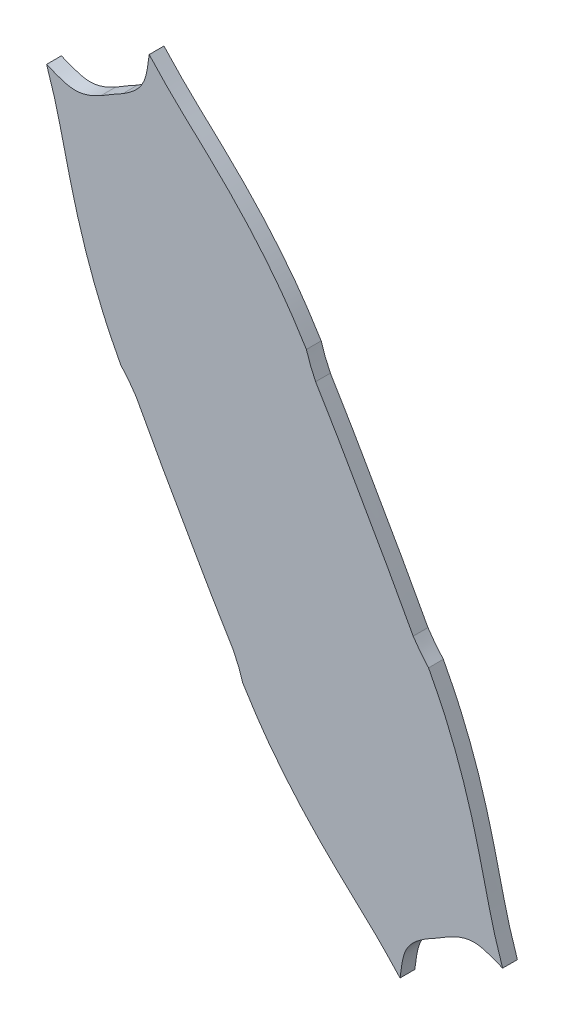
ISO-10303-21;
HEADER;
FILE_DESCRIPTION(('STEP AP214'),'2;1');
FILE_NAME('part.step','',(''),(''),'','','');
FILE_SCHEMA(('AUTOMOTIVE_DESIGN { 1 0 10303 214 1 1 1 1 }'));
ENDSEC;
DATA;
#1=APPLICATION_CONTEXT('core data for automotive mechanical design processes');
#2=APPLICATION_PROTOCOL_DEFINITION('international standard','automotive_design',2000,#1);
#3=PRODUCT_CONTEXT('',#1,'mechanical');
#4=PRODUCT('Part','Part','',(#3));
#5=PRODUCT_RELATED_PRODUCT_CATEGORY('part','',(#4));
#6=PRODUCT_DEFINITION_FORMATION('','',#4);
#7=PRODUCT_DEFINITION_CONTEXT('part definition',#1,'design');
#8=PRODUCT_DEFINITION('design','',#6,#7);
#9=PRODUCT_DEFINITION_SHAPE('','',#8);
#10=(LENGTH_UNIT() NAMED_UNIT(*) SI_UNIT(.MILLI.,.METRE.));
#11=(NAMED_UNIT(*) PLANE_ANGLE_UNIT() SI_UNIT($,.RADIAN.));
#12=(NAMED_UNIT(*) SI_UNIT($,.STERADIAN.) SOLID_ANGLE_UNIT());
#13=UNCERTAINTY_MEASURE_WITH_UNIT(LENGTH_MEASURE(1.E-05),#10,'distance_accuracy_value','');
#14=(GEOMETRIC_REPRESENTATION_CONTEXT(3) GLOBAL_UNCERTAINTY_ASSIGNED_CONTEXT((#13)) GLOBAL_UNIT_ASSIGNED_CONTEXT((#10,
#11,#12)) REPRESENTATION_CONTEXT('',''));
#15=CARTESIAN_POINT('',(0.,0.,0.));
#16=DIRECTION('',(0.,0.,1.));
#17=DIRECTION('',(1.,0.,0.));
#18=AXIS2_PLACEMENT_3D('',#15,#16,#17);
#19=CARTESIAN_POINT('',(60.0421330952947,20.3476456436608,3.));
#20=CARTESIAN_POINT('',(57.2169544135268,24.8915317290802,3.));
#21=CARTESIAN_POINT('',(55.7076119249274,27.0598183405813,3.));
#22=CARTESIAN_POINT('',(50.7192798315221,33.4486848974097,3.));
#23=CARTESIAN_POINT('',(48.0258453140473,36.4979470244591,3.));
#24=CARTESIAN_POINT('',(42.5815389218621,42.1478194340178,3.));
#25=CARTESIAN_POINT('',(40.5458192033258,44.084319783867,3.));
#26=CARTESIAN_POINT('',(32.7666877479531,51.3081925612445,3.));
#27=CARTESIAN_POINT('',(31.8043243891919,52.3000502459846,3.));
#28=CARTESIAN_POINT('',(28.1496109177657,56.2078605068888,3.));
#29=B_SPLINE_CURVE_WITH_KNOTS('',3,(#19,#20,#21,#22,#23,#24,#25,#26,#27,#28),.UNSPECIFIED.,.F.,
.F.,(4,2,2,2,4),(0.,0.25,0.5,0.75,1.),.UNSPECIFIED.);
#30=DIRECTION('',(0.,0.,-1.));
#31=VECTOR('',#30,1.);
#32=SURFACE_OF_LINEAR_EXTRUSION('',#29,#31);
#33=CARTESIAN_POINT('',(60.0421330952947,20.3476456436608,0.));
#34=CARTESIAN_POINT('',(57.2169544135268,24.8915317290802,0.));
#35=CARTESIAN_POINT('',(55.7076119249274,27.0598183405813,0.));
#36=CARTESIAN_POINT('',(50.7192798315221,33.4486848974097,0.));
#37=CARTESIAN_POINT('',(48.0258453140473,36.4979470244591,0.));
#38=CARTESIAN_POINT('',(42.5815389218621,42.1478194340178,0.));
#39=CARTESIAN_POINT('',(40.5458192033258,44.084319783867,0.));
#40=CARTESIAN_POINT('',(32.7666877479531,51.3081925612445,0.));
#41=CARTESIAN_POINT('',(31.8043243891919,52.3000502459846,0.));
#42=CARTESIAN_POINT('',(28.1496109177657,56.2078605068888,0.));
#43=B_SPLINE_CURVE_WITH_KNOTS('',3,(#33,#34,#35,#36,#37,#38,#39,#40,#41,#42),.UNSPECIFIED.,.F.,
.F.,(4,2,2,2,4),(0.,0.25,0.5,0.75,1.),.UNSPECIFIED.);
#44=CARTESIAN_POINT('',(60.0421330952947,20.3476456436608,0.));
#45=VERTEX_POINT('',#44);
#46=CARTESIAN_POINT('',(28.1496109177657,56.2078605068888,0.));
#47=VERTEX_POINT('',#46);
#48=EDGE_CURVE('E338',#45,#47,#43,.T.);
#49=ORIENTED_EDGE('',*,*,#48,.T.);
#50=DIRECTION('',(0.,0.,-1.));
#51=VECTOR('',#50,1.);
#52=CARTESIAN_POINT('',(28.1496109177657,56.2078605068888,3.));
#53=LINE('',#52,#51);
#54=CARTESIAN_POINT('',(28.1496109177657,56.2078605068888,3.));
#55=VERTEX_POINT('',#54);
#56=EDGE_CURVE('E11',#55,#47,#53,.T.);
#57=ORIENTED_EDGE('',*,*,#56,.F.);
#58=CARTESIAN_POINT('',(60.0421330952947,20.3476456436608,3.));
#59=VERTEX_POINT('',#58);
#60=EDGE_CURVE('E440',#59,#55,#29,.T.);
#61=ORIENTED_EDGE('',*,*,#60,.F.);
#62=DIRECTION('',(0.,0.,-1.));
#63=VECTOR('',#62,1.);
#64=CARTESIAN_POINT('',(60.0421330952947,20.3476456436608,3.));
#65=LINE('',#64,#63);
#66=EDGE_CURVE('E178',#59,#45,#65,.T.);
#67=ORIENTED_EDGE('',*,*,#66,.T.);
#68=EDGE_LOOP('',(#49,#57,#61,#67));
#69=FACE_BOUND('',#68,.T.);
#70=ADVANCED_FACE('F37',(#69),#32,.F.);
#71=CARTESIAN_POINT('',(28.1496109177657,56.2078605068888,3.));
#72=CARTESIAN_POINT('',(27.5609220806034,51.1468908185844,3.));
#73=CARTESIAN_POINT('',(27.1125465059913,49.3760412983253,3.));
#74=CARTESIAN_POINT('',(22.779757926252,46.6518282125896,3.));
#75=B_SPLINE_CURVE_WITH_KNOTS('',3,(#71,#72,#73,#74),.UNSPECIFIED.,.F.,.F.,(4,4),(0.,1.),.UNSPECIFIED.);
#76=DIRECTION('',(0.,0.,-1.));
#77=VECTOR('',#76,1.);
#78=SURFACE_OF_LINEAR_EXTRUSION('',#75,#77);
#79=CARTESIAN_POINT('',(28.1496109177657,56.2078605068888,0.));
#80=CARTESIAN_POINT('',(27.5609220806034,51.1468908185844,0.));
#81=CARTESIAN_POINT('',(27.1125465059913,49.3760412983253,0.));
#82=CARTESIAN_POINT('',(22.779757926252,46.6518282125896,0.));
#83=B_SPLINE_CURVE_WITH_KNOTS('',3,(#79,#80,#81,#82),.UNSPECIFIED.,.F.,.F.,(4,4),(0.,1.),.UNSPECIFIED.);
#84=CARTESIAN_POINT('',(22.779757926252,46.6518282125896,0.));
#85=VERTEX_POINT('',#84);
#86=EDGE_CURVE('E329',#47,#85,#83,.T.);
#87=ORIENTED_EDGE('',*,*,#86,.T.);
#88=DIRECTION('',(0.,0.,-1.));
#89=VECTOR('',#88,1.);
#90=CARTESIAN_POINT('',(22.779757926252,46.6518282125896,3.));
#91=LINE('',#90,#89);
#92=CARTESIAN_POINT('',(22.779757926252,46.6518282125896,3.));
#93=VERTEX_POINT('',#92);
#94=EDGE_CURVE('E46',#93,#85,#91,.T.);
#95=ORIENTED_EDGE('',*,*,#94,.F.);
#96=EDGE_CURVE('E121',#55,#93,#75,.T.);
#97=ORIENTED_EDGE('',*,*,#96,.F.);
#98=ORIENTED_EDGE('',*,*,#56,.T.);
#99=EDGE_LOOP('',(#87,#95,#97,#98));
#100=FACE_BOUND('',#99,.T.);
#101=ADVANCED_FACE('F322',(#100),#78,.F.);
#102=CARTESIAN_POINT('',(22.779757926252,46.6518282125896,3.));
#103=CARTESIAN_POINT('',(20.7689215610084,45.5475588148219,3.));
#104=CARTESIAN_POINT('',(20.2732877382308,45.2593253536309,3.));
#105=CARTESIAN_POINT('',(18.3190694392649,44.0576996904606,3.));
#106=B_SPLINE_CURVE_WITH_KNOTS('',3,(#102,#103,#104,#105),.UNSPECIFIED.,.F.,.F.,(4,4),(0.,1.),.UNSPECIFIED.);
#107=DIRECTION('',(0.,0.,-1.));
#108=VECTOR('',#107,1.);
#109=SURFACE_OF_LINEAR_EXTRUSION('',#106,#108);
#110=CARTESIAN_POINT('',(22.779757926252,46.6518282125896,0.));
#111=CARTESIAN_POINT('',(20.7689215610084,45.5475588148219,0.));
#112=CARTESIAN_POINT('',(20.2732877382308,45.2593253536309,0.));
#113=CARTESIAN_POINT('',(18.3190694392649,44.0576996904606,0.));
#114=B_SPLINE_CURVE_WITH_KNOTS('',3,(#110,#111,#112,#113),.UNSPECIFIED.,.F.,.F.,(4,4),(0.,1.),.UNSPECIFIED.);
#115=CARTESIAN_POINT('',(18.3190694392649,44.0576996904606,0.));
#116=VERTEX_POINT('',#115);
#117=EDGE_CURVE('E337',#85,#116,#114,.T.);
#118=ORIENTED_EDGE('',*,*,#117,.T.);
#119=DIRECTION('',(0.,0.,-1.));
#120=VECTOR('',#119,1.);
#121=CARTESIAN_POINT('',(18.3190694392649,44.0576996904606,3.));
#122=LINE('',#121,#120);
#123=CARTESIAN_POINT('',(18.3190694392649,44.0576996904606,3.));
#124=VERTEX_POINT('',#123);
#125=EDGE_CURVE('E342',#124,#116,#122,.T.);
#126=ORIENTED_EDGE('',*,*,#125,.F.);
#127=EDGE_CURVE('E306',#93,#124,#106,.T.);
#128=ORIENTED_EDGE('',*,*,#127,.F.);
#129=ORIENTED_EDGE('',*,*,#94,.T.);
#130=EDGE_LOOP('',(#118,#126,#128,#129));
#131=FACE_BOUND('',#130,.T.);
#132=ADVANCED_FACE('F320',(#131),#109,.F.);
#133=CARTESIAN_POINT('',(18.3190694392649,44.0576996904606,3.));
#134=CARTESIAN_POINT('',(13.8032793031474,41.6419881882541,3.));
#135=CARTESIAN_POINT('',(12.0485972328921,42.1267902494142,3.));
#136=CARTESIAN_POINT('',(7.33961787958955,44.0807269249783,3.));
#137=B_SPLINE_CURVE_WITH_KNOTS('',3,(#133,#134,#135,#136),.UNSPECIFIED.,.F.,.F.,(4,4),(0.,1.),.UNSPECIFIED.);
#138=DIRECTION('',(0.,0.,-1.));
#139=VECTOR('',#138,1.);
#140=SURFACE_OF_LINEAR_EXTRUSION('',#137,#139);
#141=CARTESIAN_POINT('',(18.3190694392649,44.0576996904606,0.));
#142=CARTESIAN_POINT('',(13.8032793031474,41.6419881882541,0.));
#143=CARTESIAN_POINT('',(12.0485972328921,42.1267902494142,0.));
#144=CARTESIAN_POINT('',(7.33961787958955,44.0807269249783,0.));
#145=B_SPLINE_CURVE_WITH_KNOTS('',3,(#141,#142,#143,#144),.UNSPECIFIED.,.F.,.F.,(4,4),(0.,1.),.UNSPECIFIED.);
#146=CARTESIAN_POINT('',(7.33961787958955,44.0807269249783,0.));
#147=VERTEX_POINT('',#146);
#148=EDGE_CURVE('E346',#116,#147,#145,.T.);
#149=ORIENTED_EDGE('',*,*,#148,.T.);
#150=DIRECTION('',(0.,0.,-1.));
#151=VECTOR('',#150,1.);
#152=CARTESIAN_POINT('',(7.33961787958955,44.0807269249783,3.));
#153=LINE('',#152,#151);
#154=CARTESIAN_POINT('',(7.33961787958955,44.0807269249783,3.));
#155=VERTEX_POINT('',#154);
#156=EDGE_CURVE('E471',#155,#147,#153,.T.);
#157=ORIENTED_EDGE('',*,*,#156,.F.);
#158=EDGE_CURVE('E298',#124,#155,#137,.T.);
#159=ORIENTED_EDGE('',*,*,#158,.F.);
#160=ORIENTED_EDGE('',*,*,#125,.T.);
#161=EDGE_LOOP('',(#149,#157,#159,#160));
#162=FACE_BOUND('',#161,.T.);
#163=ADVANCED_FACE('F290',(#162),#140,.F.);
#164=CARTESIAN_POINT('',(7.33961787958955,44.0807269249783,3.));
#165=CARTESIAN_POINT('',(8.14969927817586,41.5496425766871,3.));
#166=CARTESIAN_POINT('',(8.62152910226454,40.179387063692,3.));
#167=CARTESIAN_POINT('',(9.6285195317461,36.569244704778,3.));
#168=CARTESIAN_POINT('',(10.2752618820309,33.8427552636813,3.));
#169=CARTESIAN_POINT('',(11.1734316595371,30.0348555357346,3.));
#170=CARTESIAN_POINT('',(12.3862004853828,24.8980532126235,3.));
#171=CARTESIAN_POINT('',(14.6255483026935,17.0626509293817,3.));
#172=CARTESIAN_POINT('',(15.8167831126118,13.4618019882108,3.));
#173=CARTESIAN_POINT('',(18.8396919433883,5.84536435395485,3.));
#174=CARTESIAN_POINT('',(19.9082488305425,3.52685100953464,3.));
#175=CARTESIAN_POINT('',(22.3674472698234,-1.18521310472836,3.));
#176=B_SPLINE_CURVE_WITH_KNOTS('',3,(#164,#165,#166,#167,#168,#169,#170,#171,#172,#173,#174,
#175),.UNSPECIFIED.,.F.,.F.,(4,2,2,2,2,4),(0.,0.125,0.25,0.5,0.75,1.),.UNSPECIFIED.);
#177=DIRECTION('',(0.,0.,-1.));
#178=VECTOR('',#177,1.);
#179=SURFACE_OF_LINEAR_EXTRUSION('',#176,#178);
#180=CARTESIAN_POINT('',(7.33961787958955,44.0807269249783,0.));
#181=CARTESIAN_POINT('',(8.14969927817586,41.5496425766871,0.));
#182=CARTESIAN_POINT('',(8.62152910226454,40.179387063692,0.));
#183=CARTESIAN_POINT('',(9.6285195317461,36.569244704778,0.));
#184=CARTESIAN_POINT('',(10.2752618820309,33.8427552636813,0.));
#185=CARTESIAN_POINT('',(11.1734316595371,30.0348555357346,0.));
#186=CARTESIAN_POINT('',(12.3862004853828,24.8980532126235,0.));
#187=CARTESIAN_POINT('',(14.6255483026935,17.0626509293817,0.));
#188=CARTESIAN_POINT('',(15.8167831126118,13.4618019882108,0.));
#189=CARTESIAN_POINT('',(18.8396919433883,5.84536435395485,0.));
#190=CARTESIAN_POINT('',(19.9082488305425,3.52685100953464,0.));
#191=CARTESIAN_POINT('',(22.3674472698234,-1.18521310472836,0.));
#192=B_SPLINE_CURVE_WITH_KNOTS('',3,(#180,#181,#182,#183,#184,#185,#186,#187,#188,#189,#190,
#191),.UNSPECIFIED.,.F.,.F.,(4,2,2,2,2,4),(0.,0.125,0.25,0.5,0.75,1.),.UNSPECIFIED.);
#193=CARTESIAN_POINT('',(22.3674472698234,-1.18521310472836,0.));
#194=VERTEX_POINT('',#193);
#195=EDGE_CURVE('E348',#147,#194,#192,.T.);
#196=ORIENTED_EDGE('',*,*,#195,.T.);
#197=DIRECTION('',(0.,0.,-1.));
#198=VECTOR('',#197,1.);
#199=CARTESIAN_POINT('',(22.3674472698234,-1.18521310472836,3.));
#200=LINE('',#199,#198);
#201=CARTESIAN_POINT('',(22.3674472698234,-1.18521310472836,3.));
#202=VERTEX_POINT('',#201);
#203=EDGE_CURVE('E468',#202,#194,#200,.T.);
#204=ORIENTED_EDGE('',*,*,#203,.F.);
#205=EDGE_CURVE('E294',#155,#202,#176,.T.);
#206=ORIENTED_EDGE('',*,*,#205,.F.);
#207=ORIENTED_EDGE('',*,*,#156,.T.);
#208=EDGE_LOOP('',(#196,#204,#206,#207));
#209=FACE_BOUND('',#208,.T.);
#210=ADVANCED_FACE('F286',(#209),#179,.F.);
#211=CARTESIAN_POINT('',(22.3674472698234,-1.18521310472836,3.));
#212=CARTESIAN_POINT('',(23.8648961294466,-2.87516101991258,3.));
#213=CARTESIAN_POINT('',(24.2103659989986,-3.32013025727015,3.));
#214=CARTESIAN_POINT('',(25.4796862259662,-5.18754747891018,3.));
#215=B_SPLINE_CURVE_WITH_KNOTS('',3,(#211,#212,#213,#214),.UNSPECIFIED.,.F.,.F.,(4,4),(0.,1.),.UNSPECIFIED.);
#216=DIRECTION('',(0.,0.,-1.));
#217=VECTOR('',#216,1.);
#218=SURFACE_OF_LINEAR_EXTRUSION('',#215,#217);
#219=CARTESIAN_POINT('',(22.3674472698234,-1.18521310472836,0.));
#220=CARTESIAN_POINT('',(23.8648961294466,-2.87516101991258,0.));
#221=CARTESIAN_POINT('',(24.2103659989986,-3.32013025727015,0.));
#222=CARTESIAN_POINT('',(25.4796862259662,-5.18754747891018,0.));
#223=B_SPLINE_CURVE_WITH_KNOTS('',3,(#219,#220,#221,#222),.UNSPECIFIED.,.F.,.F.,(4,4),(0.,1.),.UNSPECIFIED.);
#224=CARTESIAN_POINT('',(25.4796862259662,-5.18754747891018,0.));
#225=VERTEX_POINT('',#224);
#226=EDGE_CURVE('E366',#194,#225,#223,.T.);
#227=ORIENTED_EDGE('',*,*,#226,.T.);
#228=DIRECTION('',(0.,0.,-1.));
#229=VECTOR('',#228,1.);
#230=CARTESIAN_POINT('',(25.4796862259662,-5.18754747891018,3.));
#231=LINE('',#230,#229);
#232=CARTESIAN_POINT('',(25.4796862259662,-5.18754747891018,3.));
#233=VERTEX_POINT('',#232);
#234=EDGE_CURVE('E465',#233,#225,#231,.T.);
#235=ORIENTED_EDGE('',*,*,#234,.F.);
#236=EDGE_CURVE('E271',#202,#233,#215,.T.);
#237=ORIENTED_EDGE('',*,*,#236,.F.);
#238=ORIENTED_EDGE('',*,*,#203,.T.);
#239=EDGE_LOOP('',(#227,#235,#237,#238));
#240=FACE_BOUND('',#239,.T.);
#241=ADVANCED_FACE('F282',(#240),#218,.F.);
#242=CARTESIAN_POINT('',(25.4796862259662,-5.18754747891018,3.));
#243=CARTESIAN_POINT('',(29.668288597569,-13.0387109682722,3.));
#244=CARTESIAN_POINT('',(31.7273417635127,-16.5520939111105,3.));
#245=CARTESIAN_POINT('',(38.6948190331138,-28.8170506562921,3.));
#246=CARTESIAN_POINT('',(40.6544001730074,-32.3873479186779,3.));
#247=CARTESIAN_POINT('',(45.2751147927235,-39.9922346855818,3.));
#248=B_SPLINE_CURVE_WITH_KNOTS('',3,(#242,#243,#244,#245,#246,#247),.UNSPECIFIED.,.F.,.F.,(4,2,
4),(0.,0.5,1.),.UNSPECIFIED.);
#249=DIRECTION('',(0.,0.,-1.));
#250=VECTOR('',#249,1.);
#251=SURFACE_OF_LINEAR_EXTRUSION('',#248,#250);
#252=CARTESIAN_POINT('',(25.4796862259662,-5.18754747891018,0.));
#253=CARTESIAN_POINT('',(29.668288597569,-13.0387109682722,0.));
#254=CARTESIAN_POINT('',(31.7273417635127,-16.5520939111105,0.));
#255=CARTESIAN_POINT('',(38.6948190331138,-28.8170506562921,0.));
#256=CARTESIAN_POINT('',(40.6544001730074,-32.3873479186779,0.));
#257=CARTESIAN_POINT('',(45.2751147927235,-39.9922346855818,0.));
#258=B_SPLINE_CURVE_WITH_KNOTS('',3,(#252,#253,#254,#255,#256,#257),.UNSPECIFIED.,.F.,.F.,(4,2,
4),(0.,0.5,1.),.UNSPECIFIED.);
#259=CARTESIAN_POINT('',(45.2751147927235,-39.9922346855818,0.));
#260=VERTEX_POINT('',#259);
#261=EDGE_CURVE('E373',#225,#260,#258,.T.);
#262=ORIENTED_EDGE('',*,*,#261,.T.);
#263=DIRECTION('',(0.,0.,-1.));
#264=VECTOR('',#263,1.);
#265=CARTESIAN_POINT('',(45.2751147927235,-39.9922346855818,3.));
#266=LINE('',#265,#264);
#267=CARTESIAN_POINT('',(45.2751147927235,-39.9922346855818,3.));
#268=VERTEX_POINT('',#267);
#269=EDGE_CURVE('E462',#268,#260,#266,.T.);
#270=ORIENTED_EDGE('',*,*,#269,.F.);
#271=EDGE_CURVE('E263',#233,#268,#248,.T.);
#272=ORIENTED_EDGE('',*,*,#271,.F.);
#273=ORIENTED_EDGE('',*,*,#234,.T.);
#274=EDGE_LOOP('',(#262,#270,#272,#273));
#275=FACE_BOUND('',#274,.T.);
#276=ADVANCED_FACE('F279',(#275),#251,.F.);
#277=CARTESIAN_POINT('',(45.2751147927235,-39.9922346855818,3.));
#278=CARTESIAN_POINT('',(46.2415338480123,-42.0442337286204,3.));
#279=CARTESIAN_POINT('',(46.4501091344471,-42.5702913992249,3.));
#280=CARTESIAN_POINT('',(47.1485382891911,-44.7282400612202,3.));
#281=B_SPLINE_CURVE_WITH_KNOTS('',3,(#277,#278,#279,#280),.UNSPECIFIED.,.F.,.F.,(4,4),(0.,1.),.UNSPECIFIED.);
#282=DIRECTION('',(0.,0.,-1.));
#283=VECTOR('',#282,1.);
#284=SURFACE_OF_LINEAR_EXTRUSION('',#281,#283);
#285=CARTESIAN_POINT('',(45.2751147927235,-39.9922346855818,0.));
#286=CARTESIAN_POINT('',(46.2415338480123,-42.0442337286204,0.));
#287=CARTESIAN_POINT('',(46.4501091344471,-42.5702913992249,0.));
#288=CARTESIAN_POINT('',(47.1485382891911,-44.7282400612202,0.));
#289=B_SPLINE_CURVE_WITH_KNOTS('',3,(#285,#286,#287,#288),.UNSPECIFIED.,.F.,.F.,(4,4),(0.,1.),.UNSPECIFIED.);
#290=CARTESIAN_POINT('',(47.1485382891911,-44.7282400612202,0.));
#291=VERTEX_POINT('',#290);
#292=EDGE_CURVE('E380',#260,#291,#289,.T.);
#293=ORIENTED_EDGE('',*,*,#292,.T.);
#294=DIRECTION('',(0.,0.,-1.));
#295=VECTOR('',#294,1.);
#296=CARTESIAN_POINT('',(47.1485382891911,-44.7282400612202,3.));
#297=LINE('',#296,#295);
#298=CARTESIAN_POINT('',(47.1485382891911,-44.7282400612202,3.));
#299=VERTEX_POINT('',#298);
#300=EDGE_CURVE('E459',#299,#291,#297,.T.);
#301=ORIENTED_EDGE('',*,*,#300,.F.);
#302=EDGE_CURVE('E255',#268,#299,#281,.T.);
#303=ORIENTED_EDGE('',*,*,#302,.F.);
#304=ORIENTED_EDGE('',*,*,#269,.T.);
#305=EDGE_LOOP('',(#293,#301,#303,#304));
#306=FACE_BOUND('',#305,.T.);
#307=ADVANCED_FACE('F247',(#306),#284,.F.);
#308=CARTESIAN_POINT('',(47.1485382891911,-44.7282400612202,3.));
#309=CARTESIAN_POINT('',(49.9734266137942,-49.2724054329457,3.));
#310=CARTESIAN_POINT('',(51.4825869348208,-51.4409330315617,3.));
#311=CARTESIAN_POINT('',(56.4707100049761,-57.8299998525502,3.));
#312=CARTESIAN_POINT('',(59.1641762180618,-60.8793463528976,3.));
#313=CARTESIAN_POINT('',(64.6086269825037,-66.5293446635063,3.));
#314=CARTESIAN_POINT('',(66.6425172840855,-68.464119623306,3.));
#315=CARTESIAN_POINT('',(74.4256936101685,-75.6913107095815,3.));
#316=CARTESIAN_POINT('',(75.3862530780201,-76.6814281397753,3.));
#317=CARTESIAN_POINT('',(79.0413186522581,-80.5890242363846,3.));
#318=B_SPLINE_CURVE_WITH_KNOTS('',3,(#308,#309,#310,#311,#312,#313,#314,#315,#316,#317),
.UNSPECIFIED.,.F.,.F.,(4,2,2,2,4),(0.,0.25,0.5,0.75,1.),.UNSPECIFIED.);
#319=DIRECTION('',(0.,0.,-1.));
#320=VECTOR('',#319,1.);
#321=SURFACE_OF_LINEAR_EXTRUSION('',#318,#320);
#322=CARTESIAN_POINT('',(47.1485382891911,-44.7282400612202,0.));
#323=CARTESIAN_POINT('',(49.9734266137942,-49.2724054329457,0.));
#324=CARTESIAN_POINT('',(51.4825869348208,-51.4409330315617,0.));
#325=CARTESIAN_POINT('',(56.4707100049761,-57.8299998525502,0.));
#326=CARTESIAN_POINT('',(59.1641762180618,-60.8793463528976,0.));
#327=CARTESIAN_POINT('',(64.6086269825037,-66.5293446635063,0.));
#328=CARTESIAN_POINT('',(66.6425172840855,-68.464119623306,0.));
#329=CARTESIAN_POINT('',(74.4256936101685,-75.6913107095815,0.));
#330=CARTESIAN_POINT('',(75.3862530780201,-76.6814281397753,0.));
#331=CARTESIAN_POINT('',(79.0413186522581,-80.5890242363846,0.));
#332=B_SPLINE_CURVE_WITH_KNOTS('',3,(#322,#323,#324,#325,#326,#327,#328,#329,#330,#331),
.UNSPECIFIED.,.F.,.F.,(4,2,2,2,4),(0.,0.25,0.5,0.75,1.),.UNSPECIFIED.);
#333=CARTESIAN_POINT('',(79.0413186522581,-80.5890242363846,0.));
#334=VERTEX_POINT('',#333);
#335=EDGE_CURVE('E387',#291,#334,#332,.T.);
#336=ORIENTED_EDGE('',*,*,#335,.T.);
#337=DIRECTION('',(0.,0.,-1.));
#338=VECTOR('',#337,1.);
#339=CARTESIAN_POINT('',(79.0413186522581,-80.5890242363846,3.));
#340=LINE('',#339,#338);
#341=CARTESIAN_POINT('',(79.0413186522581,-80.5890242363846,3.));
#342=VERTEX_POINT('',#341);
#343=EDGE_CURVE('E456',#342,#334,#340,.T.);
#344=ORIENTED_EDGE('',*,*,#343,.F.);
#345=EDGE_CURVE('E251',#299,#342,#318,.T.);
#346=ORIENTED_EDGE('',*,*,#345,.F.);
#347=ORIENTED_EDGE('',*,*,#300,.T.);
#348=EDGE_LOOP('',(#336,#344,#346,#347));
#349=FACE_BOUND('',#348,.T.);
#350=ADVANCED_FACE('F243',(#349),#321,.F.);
#351=CARTESIAN_POINT('',(79.0413186522581,-80.5890242363846,3.));
#352=CARTESIAN_POINT('',(79.6295999450475,-75.5282276608183,3.));
#353=CARTESIAN_POINT('',(80.0778394381186,-73.757405673754,3.));
#354=CARTESIAN_POINT('',(84.4102760240324,-71.0330590320669,3.));
#355=B_SPLINE_CURVE_WITH_KNOTS('',3,(#351,#352,#353,#354),.UNSPECIFIED.,.F.,.F.,(4,4),(0.,1.),.UNSPECIFIED.);
#356=DIRECTION('',(0.,0.,-1.));
#357=VECTOR('',#356,1.);
#358=SURFACE_OF_LINEAR_EXTRUSION('',#355,#357);
#359=CARTESIAN_POINT('',(79.0413186522581,-80.5890242363846,0.));
#360=CARTESIAN_POINT('',(79.6295999450475,-75.5282276608183,0.));
#361=CARTESIAN_POINT('',(80.0778394381186,-73.757405673754,0.));
#362=CARTESIAN_POINT('',(84.4102760240324,-71.0330590320669,0.));
#363=B_SPLINE_CURVE_WITH_KNOTS('',3,(#359,#360,#361,#362),.UNSPECIFIED.,.F.,.F.,(4,4),(0.,1.),.UNSPECIFIED.);
#364=CARTESIAN_POINT('',(84.4102760240324,-71.0330590320669,0.));
#365=VERTEX_POINT('',#364);
#366=EDGE_CURVE('E394',#334,#365,#363,.T.);
#367=ORIENTED_EDGE('',*,*,#366,.T.);
#368=DIRECTION('',(0.,0.,-1.));
#369=VECTOR('',#368,1.);
#370=CARTESIAN_POINT('',(84.4102760240324,-71.0330590320669,3.));
#371=LINE('',#370,#369);
#372=CARTESIAN_POINT('',(84.4102760240324,-71.0330590320669,3.));
#373=VERTEX_POINT('',#372);
#374=EDGE_CURVE('E453',#373,#365,#371,.T.);
#375=ORIENTED_EDGE('',*,*,#374,.F.);
#376=EDGE_CURVE('E228',#342,#373,#355,.T.);
#377=ORIENTED_EDGE('',*,*,#376,.F.);
#378=ORIENTED_EDGE('',*,*,#343,.T.);
#379=EDGE_LOOP('',(#367,#375,#377,#378));
#380=FACE_BOUND('',#379,.T.);
#381=ADVANCED_FACE('F239',(#380),#358,.F.);
#382=CARTESIAN_POINT('',(84.4102760240324,-71.0330590320669,3.));
#383=CARTESIAN_POINT('',(86.421198824139,-69.928740938948,3.));
#384=CARTESIAN_POINT('',(86.916885769571,-69.6405444509662,3.));
#385=CARTESIAN_POINT('',(88.8713372130167,-68.4390904900679,3.));
#386=B_SPLINE_CURVE_WITH_KNOTS('',3,(#382,#383,#384,#385),.UNSPECIFIED.,.F.,.F.,(4,4),(0.,1.),.UNSPECIFIED.);
#387=DIRECTION('',(0.,0.,-1.));
#388=VECTOR('',#387,1.);
#389=SURFACE_OF_LINEAR_EXTRUSION('',#386,#388);
#390=CARTESIAN_POINT('',(84.4102760240324,-71.0330590320669,0.));
#391=CARTESIAN_POINT('',(86.421198824139,-69.928740938948,0.));
#392=CARTESIAN_POINT('',(86.916885769571,-69.6405444509662,0.));
#393=CARTESIAN_POINT('',(88.8713372130167,-68.4390904900679,0.));
#394=B_SPLINE_CURVE_WITH_KNOTS('',3,(#390,#391,#392,#393),.UNSPECIFIED.,.F.,.F.,(4,4),(0.,1.),.UNSPECIFIED.);
#395=CARTESIAN_POINT('',(88.8713372130167,-68.4390904900679,0.));
#396=VERTEX_POINT('',#395);
#397=EDGE_CURVE('E401',#365,#396,#394,.T.);
#398=ORIENTED_EDGE('',*,*,#397,.T.);
#399=DIRECTION('',(0.,0.,-1.));
#400=VECTOR('',#399,1.);
#401=CARTESIAN_POINT('',(88.8713372130167,-68.4390904900679,3.));
#402=LINE('',#401,#400);
#403=CARTESIAN_POINT('',(88.8713372130167,-68.4390904900679,3.));
#404=VERTEX_POINT('',#403);
#405=EDGE_CURVE('E450',#404,#396,#402,.T.);
#406=ORIENTED_EDGE('',*,*,#405,.F.);
#407=EDGE_CURVE('E220',#373,#404,#386,.T.);
#408=ORIENTED_EDGE('',*,*,#407,.F.);
#409=ORIENTED_EDGE('',*,*,#374,.T.);
#410=EDGE_LOOP('',(#398,#406,#408,#409));
#411=FACE_BOUND('',#410,.T.);
#412=ADVANCED_FACE('F236',(#411),#389,.F.);
#413=CARTESIAN_POINT('',(88.8713372130167,-68.4390904900679,3.));
#414=CARTESIAN_POINT('',(93.386975511493,-66.0226425118146,3.));
#415=CARTESIAN_POINT('',(95.1418672744291,-66.5074294532787,3.));
#416=CARTESIAN_POINT('',(99.8513016836428,-68.4608780876786,3.));
#417=B_SPLINE_CURVE_WITH_KNOTS('',3,(#413,#414,#415,#416),.UNSPECIFIED.,.F.,.F.,(4,4),(0.,1.),.UNSPECIFIED.);
#418=DIRECTION('',(0.,0.,-1.));
#419=VECTOR('',#418,1.);
#420=SURFACE_OF_LINEAR_EXTRUSION('',#417,#419);
#421=CARTESIAN_POINT('',(88.8713372130167,-68.4390904900679,0.));
#422=CARTESIAN_POINT('',(93.386975511493,-66.0226425118146,0.));
#423=CARTESIAN_POINT('',(95.1418672744291,-66.5074294532787,0.));
#424=CARTESIAN_POINT('',(99.8513016836428,-68.4608780876786,0.));
#425=B_SPLINE_CURVE_WITH_KNOTS('',3,(#421,#422,#423,#424),.UNSPECIFIED.,.F.,.F.,(4,4),(0.,1.),.UNSPECIFIED.);
#426=CARTESIAN_POINT('',(99.8513016836428,-68.4608780876786,0.));
#427=VERTEX_POINT('',#426);
#428=EDGE_CURVE('E408',#396,#427,#425,.T.);
#429=ORIENTED_EDGE('',*,*,#428,.T.);
#430=DIRECTION('',(0.,0.,-1.));
#431=VECTOR('',#430,1.);
#432=CARTESIAN_POINT('',(99.8513016836428,-68.4608780876786,3.));
#433=LINE('',#432,#431);
#434=CARTESIAN_POINT('',(99.8513016836428,-68.4608780876786,3.));
#435=VERTEX_POINT('',#434);
#436=EDGE_CURVE('E447',#435,#427,#433,.T.);
#437=ORIENTED_EDGE('',*,*,#436,.F.);
#438=EDGE_CURVE('E212',#404,#435,#417,.T.);
#439=ORIENTED_EDGE('',*,*,#438,.F.);
#440=ORIENTED_EDGE('',*,*,#405,.T.);
#441=EDGE_LOOP('',(#429,#437,#439,#440));
#442=FACE_BOUND('',#441,.T.);
#443=ADVANCED_FACE('F205',(#442),#420,.F.);
#444=CARTESIAN_POINT('',(99.8513016836428,-68.4608780876786,3.));
#445=CARTESIAN_POINT('',(99.04092526752,-65.9299400521233,3.));
#446=CARTESIAN_POINT('',(98.5689609877533,-64.5598060746342,3.));
#447=CARTESIAN_POINT('',(97.5616743539009,-60.9497235714805,3.));
#448=CARTESIAN_POINT('',(96.9161305876693,-58.2289140999656,3.));
#449=CARTESIAN_POINT('',(96.0138941018876,-54.4044584920167,3.));
#450=CARTESIAN_POINT('',(94.8036740476565,-49.2789159644873,3.));
#451=CARTESIAN_POINT('',(92.564269254932,-41.4436200408159,3.));
#452=CARTESIAN_POINT('',(91.373036555963,-37.8428696482554,3.));
#453=CARTESIAN_POINT('',(88.350151426769,-30.2266055431608,3.));
#454=CARTESIAN_POINT('',(87.2815586629491,-27.9081554613314,3.));
#455=CARTESIAN_POINT('',(84.822527009091,-23.1961157051711,3.));
#456=B_SPLINE_CURVE_WITH_KNOTS('',3,(#444,#445,#446,#447,#448,#449,#450,#451,#452,#453,#454,
#455),.UNSPECIFIED.,.F.,.F.,(4,2,2,2,2,4),(0.,0.125,0.25,0.5,0.75,1.),.UNSPECIFIED.);
#457=DIRECTION('',(0.,0.,-1.));
#458=VECTOR('',#457,1.);
#459=SURFACE_OF_LINEAR_EXTRUSION('',#456,#458);
#460=CARTESIAN_POINT('',(99.8513016836428,-68.4608780876786,0.));
#461=CARTESIAN_POINT('',(99.04092526752,-65.9299400521233,0.));
#462=CARTESIAN_POINT('',(98.5689609877533,-64.5598060746342,0.));
#463=CARTESIAN_POINT('',(97.5616743539009,-60.9497235714805,0.));
#464=CARTESIAN_POINT('',(96.9161305876693,-58.2289140999656,0.));
#465=CARTESIAN_POINT('',(96.0138941018876,-54.4044584920167,0.));
#466=CARTESIAN_POINT('',(94.8036740476565,-49.2789159644873,0.));
#467=CARTESIAN_POINT('',(92.564269254932,-41.4436200408159,0.));
#468=CARTESIAN_POINT('',(91.373036555963,-37.8428696482554,0.));
#469=CARTESIAN_POINT('',(88.350151426769,-30.2266055431608,0.));
#470=CARTESIAN_POINT('',(87.2815586629491,-27.9081554613314,0.));
#471=CARTESIAN_POINT('',(84.822527009091,-23.1961157051711,0.));
#472=B_SPLINE_CURVE_WITH_KNOTS('',3,(#460,#461,#462,#463,#464,#465,#466,#467,#468,#469,#470,
#471),.UNSPECIFIED.,.F.,.F.,(4,2,2,2,2,4),(0.,0.125,0.25,0.5,0.75,1.),.UNSPECIFIED.);
#473=CARTESIAN_POINT('',(84.822527009091,-23.1961157051711,0.));
#474=VERTEX_POINT('',#473);
#475=EDGE_CURVE('E415',#427,#474,#472,.T.);
#476=ORIENTED_EDGE('',*,*,#475,.T.);
#477=DIRECTION('',(0.,0.,-1.));
#478=VECTOR('',#477,1.);
#479=CARTESIAN_POINT('',(84.822527009091,-23.1961157051711,3.));
#480=LINE('',#479,#478);
#481=CARTESIAN_POINT('',(84.822527009091,-23.1961157051711,3.));
#482=VERTEX_POINT('',#481);
#483=EDGE_CURVE('E173',#482,#474,#480,.T.);
#484=ORIENTED_EDGE('',*,*,#483,.F.);
#485=EDGE_CURVE('E164',#435,#482,#456,.T.);
#486=ORIENTED_EDGE('',*,*,#485,.F.);
#487=ORIENTED_EDGE('',*,*,#436,.T.);
#488=EDGE_LOOP('',(#476,#484,#486,#487));
#489=FACE_BOUND('',#488,.T.);
#490=ADVANCED_FACE('F202',(#489),#459,.F.);
#491=CARTESIAN_POINT('',(84.822527009091,-23.1961157051711,3.));
#492=CARTESIAN_POINT('',(83.3251228620959,-21.5060346994634,3.));
#493=CARTESIAN_POINT('',(82.9796674263294,-21.0610320844488,3.));
#494=CARTESIAN_POINT('',(81.7104024244434,-19.1934878612779,3.));
#495=B_SPLINE_CURVE_WITH_KNOTS('',3,(#491,#492,#493,#494),.UNSPECIFIED.,.F.,.F.,(4,4),(0.,1.),.UNSPECIFIED.);
#496=DIRECTION('',(0.,0.,-1.));
#497=VECTOR('',#496,1.);
#498=SURFACE_OF_LINEAR_EXTRUSION('',#495,#497);
#499=CARTESIAN_POINT('',(84.822527009091,-23.1961157051711,0.));
#500=CARTESIAN_POINT('',(83.3251228620959,-21.5060346994634,0.));
#501=CARTESIAN_POINT('',(82.9796674263294,-21.0610320844488,0.));
#502=CARTESIAN_POINT('',(81.7104024244434,-19.1934878612779,0.));
#503=B_SPLINE_CURVE_WITH_KNOTS('',3,(#499,#500,#501,#502),.UNSPECIFIED.,.F.,.F.,(4,4),(0.,1.),.UNSPECIFIED.);
#504=CARTESIAN_POINT('',(81.7104024244434,-19.1934878612779,0.));
#505=VERTEX_POINT('',#504);
#506=EDGE_CURVE('E172',#474,#505,#503,.T.);
#507=ORIENTED_EDGE('',*,*,#506,.T.);
#508=DIRECTION('',(0.,0.,-1.));
#509=VECTOR('',#508,1.);
#510=CARTESIAN_POINT('',(81.7104024244434,-19.1934878612779,3.));
#511=LINE('',#510,#509);
#512=CARTESIAN_POINT('',(81.7104024244434,-19.1934878612779,3.));
#513=VERTEX_POINT('',#512);
#514=EDGE_CURVE('E169',#513,#505,#511,.T.);
#515=ORIENTED_EDGE('',*,*,#514,.F.);
#516=EDGE_CURVE('E158',#482,#513,#495,.T.);
#517=ORIENTED_EDGE('',*,*,#516,.F.);
#518=ORIENTED_EDGE('',*,*,#483,.T.);
#519=EDGE_LOOP('',(#507,#515,#517,#518));
#520=FACE_BOUND('',#519,.T.);
#521=ADVANCED_FACE('F170',(#520),#498,.F.);
#522=CARTESIAN_POINT('',(81.7104024244434,-19.1934878612779,3.));
#523=CARTESIAN_POINT('',(77.522252219409,-11.3422799261157,3.));
#524=CARTESIAN_POINT('',(75.5885245738134,-8.05046196501192,3.));
#525=CARTESIAN_POINT('',(68.3695103839436,4.65670112370725,3.));
#526=CARTESIAN_POINT('',(66.5335564435309,8.00436879551145,3.));
#527=CARTESIAN_POINT('',(61.9154203705722,15.610629705334,3.));
#528=B_SPLINE_CURVE_WITH_KNOTS('',3,(#522,#523,#524,#525,#526,#527),.UNSPECIFIED.,.F.,.F.,(4,2,
4),(0.,0.5,1.),.UNSPECIFIED.);
#529=DIRECTION('',(0.,0.,-1.));
#530=VECTOR('',#529,1.);
#531=SURFACE_OF_LINEAR_EXTRUSION('',#528,#530);
#532=CARTESIAN_POINT('',(81.7104024244434,-19.1934878612779,0.));
#533=CARTESIAN_POINT('',(77.522252219409,-11.3422799261157,0.));
#534=CARTESIAN_POINT('',(75.5885245738134,-8.05046196501192,0.));
#535=CARTESIAN_POINT('',(68.3695103839436,4.65670112370725,0.));
#536=CARTESIAN_POINT('',(66.5335564435309,8.00436879551145,0.));
#537=CARTESIAN_POINT('',(61.9154203705722,15.610629705334,0.));
#538=B_SPLINE_CURVE_WITH_KNOTS('',3,(#532,#533,#534,#535,#536,#537),.UNSPECIFIED.,.F.,.F.,(4,2,
4),(0.,0.5,1.),.UNSPECIFIED.);
#539=CARTESIAN_POINT('',(61.9154203705722,15.610629705334,0.));
#540=VERTEX_POINT('',#539);
#541=EDGE_CURVE('E107',#505,#540,#538,.T.);
#542=ORIENTED_EDGE('',*,*,#541,.T.);
#543=DIRECTION('',(0.,0.,-1.));
#544=VECTOR('',#543,1.);
#545=CARTESIAN_POINT('',(61.9154203705722,15.610629705334,3.));
#546=LINE('',#545,#544);
#547=CARTESIAN_POINT('',(61.9154203705722,15.610629705334,3.));
#548=VERTEX_POINT('',#547);
#549=EDGE_CURVE('E174',#548,#540,#546,.T.);
#550=ORIENTED_EDGE('',*,*,#549,.F.);
#551=EDGE_CURVE('E162',#513,#548,#528,.T.);
#552=ORIENTED_EDGE('',*,*,#551,.F.);
#553=ORIENTED_EDGE('',*,*,#514,.T.);
#554=EDGE_LOOP('',(#542,#550,#552,#553));
#555=FACE_BOUND('',#554,.T.);
#556=ADVANCED_FACE('F176',(#555),#531,.F.);
#557=CARTESIAN_POINT('',(61.9154203705722,15.610629705334,3.));
#558=CARTESIAN_POINT('',(60.9494234066905,17.6632224723025,3.));
#559=CARTESIAN_POINT('',(60.7408645419743,18.189405403119,3.));
#560=CARTESIAN_POINT('',(60.0421330952947,20.3476456436608,3.));
#561=B_SPLINE_CURVE_WITH_KNOTS('',3,(#557,#558,#559,#560),.UNSPECIFIED.,.F.,.F.,(4,4),(0.,1.),.UNSPECIFIED.);
#562=DIRECTION('',(0.,0.,-1.));
#563=VECTOR('',#562,1.);
#564=SURFACE_OF_LINEAR_EXTRUSION('',#561,#563);
#565=CARTESIAN_POINT('',(61.9154203705722,15.610629705334,0.));
#566=CARTESIAN_POINT('',(60.9494234066905,17.6632224723025,0.));
#567=CARTESIAN_POINT('',(60.7408645419743,18.189405403119,0.));
#568=CARTESIAN_POINT('',(60.0421330952947,20.3476456436608,0.));
#569=B_SPLINE_CURVE_WITH_KNOTS('',3,(#565,#566,#567,#568),.UNSPECIFIED.,.F.,.F.,(4,4),(0.,1.),.UNSPECIFIED.);
#570=EDGE_CURVE('E113',#540,#45,#569,.T.);
#571=ORIENTED_EDGE('',*,*,#570,.T.);
#572=ORIENTED_EDGE('',*,*,#66,.F.);
#573=EDGE_CURVE('E54',#548,#59,#561,.T.);
#574=ORIENTED_EDGE('',*,*,#573,.F.);
#575=ORIENTED_EDGE('',*,*,#549,.T.);
#576=EDGE_LOOP('',(#571,#572,#574,#575));
#577=FACE_BOUND('',#576,.T.);
#578=ADVANCED_FACE('F198',(#577),#564,.F.);
#579=CARTESIAN_POINT('',(45.3036921179547,39.3228832292384,3.));
#580=DIRECTION('',(0.,0.,-1.));
#581=DIRECTION('',(-1.,0.,0.));
#582=AXIS2_PLACEMENT_3D('',#579,#580,#581);
#583=PLANE('',#582);
#584=ORIENTED_EDGE('',*,*,#60,.T.);
#585=ORIENTED_EDGE('',*,*,#96,.T.);
#586=ORIENTED_EDGE('',*,*,#127,.T.);
#587=ORIENTED_EDGE('',*,*,#158,.T.);
#588=ORIENTED_EDGE('',*,*,#205,.T.);
#589=ORIENTED_EDGE('',*,*,#236,.T.);
#590=ORIENTED_EDGE('',*,*,#271,.T.);
#591=ORIENTED_EDGE('',*,*,#302,.T.);
#592=ORIENTED_EDGE('',*,*,#345,.T.);
#593=ORIENTED_EDGE('',*,*,#376,.T.);
#594=ORIENTED_EDGE('',*,*,#407,.T.);
#595=ORIENTED_EDGE('',*,*,#438,.T.);
#596=ORIENTED_EDGE('',*,*,#485,.T.);
#597=ORIENTED_EDGE('',*,*,#516,.T.);
#598=ORIENTED_EDGE('',*,*,#551,.T.);
#599=ORIENTED_EDGE('',*,*,#573,.T.);
#600=EDGE_LOOP('',(#584,#585,#586,#587,#588,#589,#590,#591,#592,#593,#594,#595,#596,#597,#598,#599));
#601=FACE_BOUND('',#600,.T.);
#602=ADVANCED_FACE('F160',(#601),#583,.F.);
#603=CARTESIAN_POINT('',(45.3036921179547,39.3228832292384,0.));
#604=DIRECTION('',(0.,0.,-1.));
#605=DIRECTION('',(-1.,0.,0.));
#606=AXIS2_PLACEMENT_3D('',#603,#604,#605);
#607=PLANE('',#606);
#608=ORIENTED_EDGE('',*,*,#48,.F.);
#609=ORIENTED_EDGE('',*,*,#570,.F.);
#610=ORIENTED_EDGE('',*,*,#541,.F.);
#611=ORIENTED_EDGE('',*,*,#506,.F.);
#612=ORIENTED_EDGE('',*,*,#475,.F.);
#613=ORIENTED_EDGE('',*,*,#428,.F.);
#614=ORIENTED_EDGE('',*,*,#397,.F.);
#615=ORIENTED_EDGE('',*,*,#366,.F.);
#616=ORIENTED_EDGE('',*,*,#335,.F.);
#617=ORIENTED_EDGE('',*,*,#292,.F.);
#618=ORIENTED_EDGE('',*,*,#261,.F.);
#619=ORIENTED_EDGE('',*,*,#226,.F.);
#620=ORIENTED_EDGE('',*,*,#195,.F.);
#621=ORIENTED_EDGE('',*,*,#148,.F.);
#622=ORIENTED_EDGE('',*,*,#117,.F.);
#623=ORIENTED_EDGE('',*,*,#86,.F.);
#624=EDGE_LOOP('',(#608,#609,#610,#611,#612,#613,#614,#615,#616,#617,#618,#619,#620,#621,#622,#623));
#625=FACE_BOUND('',#624,.T.);
#626=ADVANCED_FACE('F344',(#625),#607,.T.);
#627=CLOSED_SHELL('',(#70,#101,#132,#163,#210,#241,#276,#307,#350,#381,#412,#443,#490,#521,#556,
#578,#602,#626));
#628=MANIFOLD_SOLID_BREP('B2',#627);
#629=ADVANCED_BREP_SHAPE_REPRESENTATION('',(#18,#628),#14);
#630=SHAPE_DEFINITION_REPRESENTATION(#9,#629);
ENDSEC;
END-ISO-10303-21;
